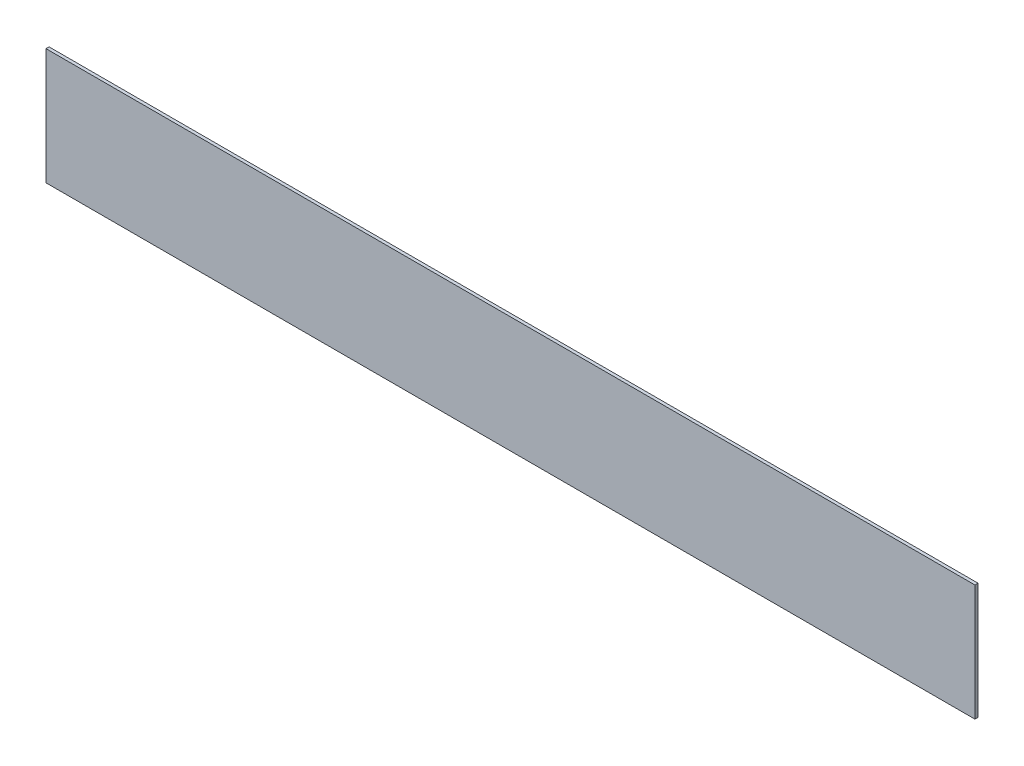
ISO-10303-21;
HEADER;
FILE_DESCRIPTION(('STEP AP214'),'2;1');
FILE_NAME('part.step','',(''),(''),'','','');
FILE_SCHEMA(('AUTOMOTIVE_DESIGN { 1 0 10303 214 1 1 1 1 }'));
ENDSEC;
DATA;
#1=APPLICATION_CONTEXT('core data for automotive mechanical design processes');
#2=APPLICATION_PROTOCOL_DEFINITION('international standard','automotive_design',2000,#1);
#3=PRODUCT_CONTEXT('',#1,'mechanical');
#4=PRODUCT('Part','Part','',(#3));
#5=PRODUCT_RELATED_PRODUCT_CATEGORY('part','',(#4));
#6=PRODUCT_DEFINITION_FORMATION('','',#4);
#7=PRODUCT_DEFINITION_CONTEXT('part definition',#1,'design');
#8=PRODUCT_DEFINITION('design','',#6,#7);
#9=PRODUCT_DEFINITION_SHAPE('','',#8);
#10=(LENGTH_UNIT() NAMED_UNIT(*) SI_UNIT(.MILLI.,.METRE.));
#11=(NAMED_UNIT(*) PLANE_ANGLE_UNIT() SI_UNIT($,.RADIAN.));
#12=(NAMED_UNIT(*) SI_UNIT($,.STERADIAN.) SOLID_ANGLE_UNIT());
#13=UNCERTAINTY_MEASURE_WITH_UNIT(LENGTH_MEASURE(1.E-05),#10,'distance_accuracy_value','');
#14=(GEOMETRIC_REPRESENTATION_CONTEXT(3) GLOBAL_UNCERTAINTY_ASSIGNED_CONTEXT((#13)) GLOBAL_UNIT_ASSIGNED_CONTEXT((#10,
#11,#12)) REPRESENTATION_CONTEXT('',''));
#15=CARTESIAN_POINT('',(0.,0.,0.));
#16=DIRECTION('',(0.,0.,1.));
#17=DIRECTION('',(1.,0.,0.));
#18=AXIS2_PLACEMENT_3D('',#15,#16,#17);
#19=CARTESIAN_POINT('',(599.5,-75.,4.));
#20=DIRECTION('',(-1.,0.,0.));
#21=DIRECTION('',(0.,0.,1.));
#22=AXIS2_PLACEMENT_3D('',#19,#20,#21);
#23=PLANE('',#22);
#24=DIRECTION('',(0.,1.,0.));
#25=VECTOR('',#24,1.);
#26=CARTESIAN_POINT('',(599.5,-75.,0.));
#27=LINE('',#26,#25);
#28=CARTESIAN_POINT('',(599.5,-75.,0.));
#29=VERTEX_POINT('',#28);
#30=CARTESIAN_POINT('',(599.5,75.,0.));
#31=VERTEX_POINT('',#30);
#32=EDGE_CURVE('E107',#29,#31,#27,.T.);
#33=ORIENTED_EDGE('',*,*,#32,.T.);
#34=DIRECTION('',(0.,0.,-1.));
#35=VECTOR('',#34,1.);
#36=CARTESIAN_POINT('',(599.5,75.,4.));
#37=LINE('',#36,#35);
#38=CARTESIAN_POINT('',(599.5,75.,4.));
#39=VERTEX_POINT('',#38);
#40=EDGE_CURVE('E11',#39,#31,#37,.T.);
#41=ORIENTED_EDGE('',*,*,#40,.F.);
#42=DIRECTION('',(0.,1.,0.));
#43=VECTOR('',#42,1.);
#44=CARTESIAN_POINT('',(599.5,-75.,4.));
#45=LINE('',#44,#43);
#46=CARTESIAN_POINT('',(599.5,-75.,4.));
#47=VERTEX_POINT('',#46);
#48=EDGE_CURVE('E91',#47,#39,#45,.T.);
#49=ORIENTED_EDGE('',*,*,#48,.F.);
#50=DIRECTION('',(0.,0.,-1.));
#51=VECTOR('',#50,1.);
#52=CARTESIAN_POINT('',(599.5,-75.,4.));
#53=LINE('',#52,#51);
#54=EDGE_CURVE('E103',#47,#29,#53,.T.);
#55=ORIENTED_EDGE('',*,*,#54,.T.);
#56=EDGE_LOOP('',(#33,#41,#49,#55));
#57=FACE_BOUND('',#56,.T.);
#58=ADVANCED_FACE('F39',(#57),#23,.F.);
#59=CARTESIAN_POINT('',(-599.5,75.,4.));
#60=DIRECTION('',(0.,-1.,0.));
#61=DIRECTION('',(0.,0.,-1.));
#62=AXIS2_PLACEMENT_3D('',#59,#60,#61);
#63=PLANE('',#62);
#64=DIRECTION('',(-1.,0.,0.));
#65=VECTOR('',#64,1.);
#66=CARTESIAN_POINT('',(-599.5,75.,0.));
#67=LINE('',#66,#65);
#68=CARTESIAN_POINT('',(-599.5,75.,0.));
#69=VERTEX_POINT('',#68);
#70=EDGE_CURVE('E96',#31,#69,#67,.T.);
#71=ORIENTED_EDGE('',*,*,#70,.T.);
#72=DIRECTION('',(0.,0.,-1.));
#73=VECTOR('',#72,1.);
#74=CARTESIAN_POINT('',(-599.5,75.,4.));
#75=LINE('',#74,#73);
#76=CARTESIAN_POINT('',(-599.5,75.,4.));
#77=VERTEX_POINT('',#76);
#78=EDGE_CURVE('E48',#77,#69,#75,.T.);
#79=ORIENTED_EDGE('',*,*,#78,.F.);
#80=DIRECTION('',(-1.,0.,0.));
#81=VECTOR('',#80,1.);
#82=CARTESIAN_POINT('',(-599.5,75.,4.));
#83=LINE('',#82,#81);
#84=EDGE_CURVE('E86',#39,#77,#83,.T.);
#85=ORIENTED_EDGE('',*,*,#84,.F.);
#86=ORIENTED_EDGE('',*,*,#40,.T.);
#87=EDGE_LOOP('',(#71,#79,#85,#86));
#88=FACE_BOUND('',#87,.T.);
#89=ADVANCED_FACE('F95',(#88),#63,.F.);
#90=CARTESIAN_POINT('',(-599.5,-75.,4.));
#91=DIRECTION('',(1.,0.,0.));
#92=DIRECTION('',(0.,0.,-1.));
#93=AXIS2_PLACEMENT_3D('',#90,#91,#92);
#94=PLANE('',#93);
#95=DIRECTION('',(0.,-1.,0.));
#96=VECTOR('',#95,1.);
#97=CARTESIAN_POINT('',(-599.5,-75.,0.));
#98=LINE('',#97,#96);
#99=CARTESIAN_POINT('',(-599.5,-75.,0.));
#100=VERTEX_POINT('',#99);
#101=EDGE_CURVE('E73',#69,#100,#98,.T.);
#102=ORIENTED_EDGE('',*,*,#101,.T.);
#103=DIRECTION('',(0.,0.,-1.));
#104=VECTOR('',#103,1.);
#105=CARTESIAN_POINT('',(-599.5,-75.,4.));
#106=LINE('',#105,#104);
#107=CARTESIAN_POINT('',(-599.5,-75.,4.));
#108=VERTEX_POINT('',#107);
#109=EDGE_CURVE('E98',#108,#100,#106,.T.);
#110=ORIENTED_EDGE('',*,*,#109,.F.);
#111=DIRECTION('',(0.,-1.,0.));
#112=VECTOR('',#111,1.);
#113=CARTESIAN_POINT('',(-599.5,-75.,4.));
#114=LINE('',#113,#112);
#115=EDGE_CURVE('E89',#77,#108,#114,.T.);
#116=ORIENTED_EDGE('',*,*,#115,.F.);
#117=ORIENTED_EDGE('',*,*,#78,.T.);
#118=EDGE_LOOP('',(#102,#110,#116,#117));
#119=FACE_BOUND('',#118,.T.);
#120=ADVANCED_FACE('F99',(#119),#94,.F.);
#121=CARTESIAN_POINT('',(-599.5,-75.,4.));
#122=DIRECTION('',(0.,1.,0.));
#123=DIRECTION('',(0.,0.,1.));
#124=AXIS2_PLACEMENT_3D('',#121,#122,#123);
#125=PLANE('',#124);
#126=DIRECTION('',(1.,0.,0.));
#127=VECTOR('',#126,1.);
#128=CARTESIAN_POINT('',(-599.5,-75.,0.));
#129=LINE('',#128,#127);
#130=EDGE_CURVE('E79',#100,#29,#129,.T.);
#131=ORIENTED_EDGE('',*,*,#130,.T.);
#132=ORIENTED_EDGE('',*,*,#54,.F.);
#133=DIRECTION('',(1.,0.,0.));
#134=VECTOR('',#133,1.);
#135=CARTESIAN_POINT('',(-599.5,-75.,4.));
#136=LINE('',#135,#134);
#137=EDGE_CURVE('E56',#108,#47,#136,.T.);
#138=ORIENTED_EDGE('',*,*,#137,.F.);
#139=ORIENTED_EDGE('',*,*,#109,.T.);
#140=EDGE_LOOP('',(#131,#132,#138,#139));
#141=FACE_BOUND('',#140,.T.);
#142=ADVANCED_FACE('F120',(#141),#125,.F.);
#143=CARTESIAN_POINT('',(0.,0.,4.));
#144=DIRECTION('',(0.,0.,-1.));
#145=DIRECTION('',(-1.,0.,0.));
#146=AXIS2_PLACEMENT_3D('',#143,#144,#145);
#147=PLANE('',#146);
#148=ORIENTED_EDGE('',*,*,#48,.T.);
#149=ORIENTED_EDGE('',*,*,#84,.T.);
#150=ORIENTED_EDGE('',*,*,#115,.T.);
#151=ORIENTED_EDGE('',*,*,#137,.T.);
#152=EDGE_LOOP('',(#148,#149,#150,#151));
#153=FACE_BOUND('',#152,.T.);
#154=ADVANCED_FACE('F87',(#153),#147,.F.);
#155=CARTESIAN_POINT('',(0.,0.,0.));
#156=DIRECTION('',(0.,0.,-1.));
#157=DIRECTION('',(-1.,0.,0.));
#158=AXIS2_PLACEMENT_3D('',#155,#156,#157);
#159=PLANE('',#158);
#160=ORIENTED_EDGE('',*,*,#32,.F.);
#161=ORIENTED_EDGE('',*,*,#130,.F.);
#162=ORIENTED_EDGE('',*,*,#101,.F.);
#163=ORIENTED_EDGE('',*,*,#70,.F.);
#164=EDGE_LOOP('',(#160,#161,#162,#163));
#165=FACE_BOUND('',#164,.T.);
#166=ADVANCED_FACE('F123',(#165),#159,.T.);
#167=CLOSED_SHELL('',(#58,#89,#120,#142,#154,#166));
#168=MANIFOLD_SOLID_BREP('B2',#167);
#169=ADVANCED_BREP_SHAPE_REPRESENTATION('',(#18,#168),#14);
#170=SHAPE_DEFINITION_REPRESENTATION(#9,#169);
ENDSEC;
END-ISO-10303-21;
